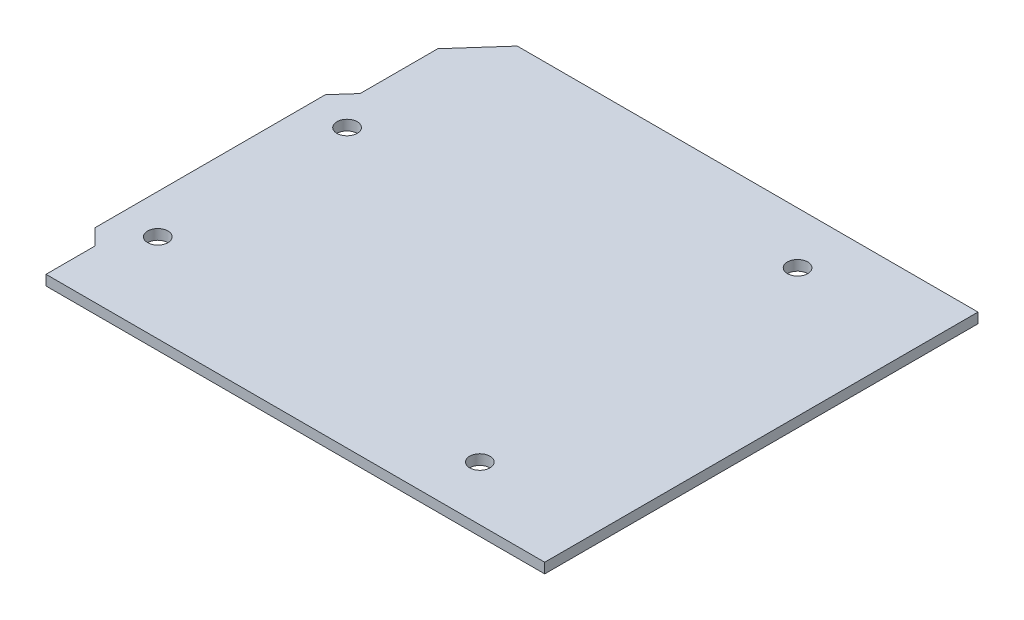
ISO-10303-21;
HEADER;
FILE_DESCRIPTION(('STEP AP214'),'2;1');
FILE_NAME('part.step','',(''),(''),'','','');
FILE_SCHEMA(('AUTOMOTIVE_DESIGN { 1 0 10303 214 1 1 1 1 }'));
ENDSEC;
DATA;
#1=APPLICATION_CONTEXT('core data for automotive mechanical design processes');
#2=APPLICATION_PROTOCOL_DEFINITION('international standard','automotive_design',2000,#1);
#3=PRODUCT_CONTEXT('',#1,'mechanical');
#4=PRODUCT('Part','Part','',(#3));
#5=PRODUCT_RELATED_PRODUCT_CATEGORY('part','',(#4));
#6=PRODUCT_DEFINITION_FORMATION('','',#4);
#7=PRODUCT_DEFINITION_CONTEXT('part definition',#1,'design');
#8=PRODUCT_DEFINITION('design','',#6,#7);
#9=PRODUCT_DEFINITION_SHAPE('','',#8);
#10=(LENGTH_UNIT() NAMED_UNIT(*) SI_UNIT(.MILLI.,.METRE.));
#11=(NAMED_UNIT(*) PLANE_ANGLE_UNIT() SI_UNIT($,.RADIAN.));
#12=(NAMED_UNIT(*) SI_UNIT($,.STERADIAN.) SOLID_ANGLE_UNIT());
#13=UNCERTAINTY_MEASURE_WITH_UNIT(LENGTH_MEASURE(1.E-05),#10,'distance_accuracy_value','');
#14=(GEOMETRIC_REPRESENTATION_CONTEXT(3) GLOBAL_UNCERTAINTY_ASSIGNED_CONTEXT((#13)) GLOBAL_UNIT_ASSIGNED_CONTEXT((#10,
#11,#12)) REPRESENTATION_CONTEXT('',''));
#15=CARTESIAN_POINT('',(0.,0.,0.));
#16=DIRECTION('',(0.,0.,1.));
#17=DIRECTION('',(1.,0.,0.));
#18=AXIS2_PLACEMENT_3D('',#15,#16,#17);
#19=CARTESIAN_POINT('',(-31.9361727476913,1.5,-32.1641220134032));
#20=DIRECTION('',(0.,0.,1.));
#21=DIRECTION('',(1.,0.,0.));
#22=AXIS2_PLACEMENT_3D('',#19,#20,#21);
#23=PLANE('',#22);
#24=DIRECTION('',(-1.,0.,0.));
#25=VECTOR('',#24,1.);
#26=CARTESIAN_POINT('',(-31.9361727476913,0.,-32.1641220134032));
#27=LINE('',#26,#25);
#28=CARTESIAN_POINT('',(36.1142071981815,0.,-32.1641220134031));
#29=VERTEX_POINT('',#28);
#30=CARTESIAN_POINT('',(-31.9361727476913,0.,-32.1641220134032));
#31=VERTEX_POINT('',#30);
#32=EDGE_CURVE('E164',#29,#31,#27,.T.);
#33=ORIENTED_EDGE('',*,*,#32,.T.);
#34=DIRECTION('',(0.,-1.,0.));
#35=VECTOR('',#34,1.);
#36=CARTESIAN_POINT('',(-31.9361727476913,1.5,-32.1641220134032));
#37=LINE('',#36,#35);
#38=CARTESIAN_POINT('',(-31.9361727476913,1.5,-32.1641220134032));
#39=VERTEX_POINT('',#38);
#40=EDGE_CURVE('E13',#39,#31,#37,.T.);
#41=ORIENTED_EDGE('',*,*,#40,.F.);
#42=DIRECTION('',(-1.,0.,0.));
#43=VECTOR('',#42,1.);
#44=CARTESIAN_POINT('',(-31.9361727476913,1.5,-32.1641220134032));
#45=LINE('',#44,#43);
#46=CARTESIAN_POINT('',(36.1142071981815,1.5,-32.1641220134031));
#47=VERTEX_POINT('',#46);
#48=EDGE_CURVE('E190',#47,#39,#45,.T.);
#49=ORIENTED_EDGE('',*,*,#48,.F.);
#50=DIRECTION('',(0.,-1.,0.));
#51=VECTOR('',#50,1.);
#52=CARTESIAN_POINT('',(36.1142071981815,1.5,-32.1641220134031));
#53=LINE('',#52,#51);
#54=EDGE_CURVE('E160',#47,#29,#53,.T.);
#55=ORIENTED_EDGE('',*,*,#54,.T.);
#56=EDGE_LOOP('',(#33,#41,#49,#55));
#57=FACE_BOUND('',#56,.T.);
#58=ADVANCED_FACE('F56',(#57),#23,.F.);
#59=CARTESIAN_POINT('',(-31.9361727476913,1.5,-32.1641220134032));
#60=DIRECTION('',(0.746798709244885,0.,0.665050139365577));
#61=DIRECTION('',(0.665050139365577,0.,-0.746798709244885));
#62=AXIS2_PLACEMENT_3D('',#59,#60,#61);
#63=PLANE('',#62);
#64=DIRECTION('',(-0.665050139365577,0.,0.746798709244885));
#65=VECTOR('',#64,1.);
#66=CARTESIAN_POINT('',(-31.9361727476913,0.,-32.1641220134032));
#67=LINE('',#66,#65);
#68=CARTESIAN_POINT('',(-37.4686203698186,0.,-25.9516208821186));
#69=VERTEX_POINT('',#68);
#70=EDGE_CURVE('E168',#31,#69,#67,.T.);
#71=ORIENTED_EDGE('',*,*,#70,.T.);
#72=DIRECTION('',(0.,-1.,0.));
#73=VECTOR('',#72,1.);
#74=CARTESIAN_POINT('',(-37.4686203698186,1.5,-25.9516208821186));
#75=LINE('',#74,#73);
#76=CARTESIAN_POINT('',(-37.4686203698186,1.5,-25.9516208821186));
#77=VERTEX_POINT('',#76);
#78=EDGE_CURVE('E65',#77,#69,#75,.T.);
#79=ORIENTED_EDGE('',*,*,#78,.F.);
#80=DIRECTION('',(-0.665050139365577,0.,0.746798709244885));
#81=VECTOR('',#80,1.);
#82=CARTESIAN_POINT('',(-31.9361727476913,1.5,-32.1641220134032));
#83=LINE('',#82,#81);
#84=EDGE_CURVE('E118',#39,#77,#83,.T.);
#85=ORIENTED_EDGE('',*,*,#84,.F.);
#86=ORIENTED_EDGE('',*,*,#40,.T.);
#87=EDGE_LOOP('',(#71,#79,#85,#86));
#88=FACE_BOUND('',#87,.T.);
#89=ADVANCED_FACE('F297',(#88),#63,.F.);
#90=CARTESIAN_POINT('',(-37.4686203698186,1.5,-25.9516208821186));
#91=DIRECTION('',(1.,0.,0.));
#92=DIRECTION('',(0.,0.,-1.));
#93=AXIS2_PLACEMENT_3D('',#90,#91,#92);
#94=PLANE('',#93);
#95=DIRECTION('',(0.,0.,1.));
#96=VECTOR('',#95,1.);
#97=CARTESIAN_POINT('',(-37.4686203698186,0.,-25.9516208821186));
#98=LINE('',#97,#96);
#99=CARTESIAN_POINT('',(-37.4686203698186,0.,-14.4830505743415));
#100=VERTEX_POINT('',#99);
#101=EDGE_CURVE('E172',#69,#100,#98,.T.);
#102=ORIENTED_EDGE('',*,*,#101,.T.);
#103=DIRECTION('',(0.,-1.,0.));
#104=VECTOR('',#103,1.);
#105=CARTESIAN_POINT('',(-37.4686203698186,1.5,-14.4830505743415));
#106=LINE('',#105,#104);
#107=CARTESIAN_POINT('',(-37.4686203698186,1.5,-14.4830505743415));
#108=VERTEX_POINT('',#107);
#109=EDGE_CURVE('E205',#108,#100,#106,.T.);
#110=ORIENTED_EDGE('',*,*,#109,.F.);
#111=DIRECTION('',(0.,0.,1.));
#112=VECTOR('',#111,1.);
#113=CARTESIAN_POINT('',(-37.4686203698186,1.5,-25.9516208821186));
#114=LINE('',#113,#112);
#115=EDGE_CURVE('E216',#77,#108,#114,.T.);
#116=ORIENTED_EDGE('',*,*,#115,.F.);
#117=ORIENTED_EDGE('',*,*,#78,.T.);
#118=EDGE_LOOP('',(#102,#110,#116,#117));
#119=FACE_BOUND('',#118,.T.);
#120=ADVANCED_FACE('F214',(#119),#94,.F.);
#121=CARTESIAN_POINT('',(-37.4686203698186,1.5,-14.4830505743415));
#122=DIRECTION('',(0.746798709244885,0.,0.665050139365577));
#123=DIRECTION('',(0.665050139365577,0.,-0.746798709244885));
#124=AXIS2_PLACEMENT_3D('',#121,#122,#123);
#125=PLANE('',#124);
#126=DIRECTION('',(-0.665050139365577,0.,0.746798709244885));
#127=VECTOR('',#126,1.);
#128=CARTESIAN_POINT('',(-37.4686203698186,0.,-14.4830505743415));
#129=LINE('',#128,#127);
#130=CARTESIAN_POINT('',(-39.8857928018185,0.,-11.7687571017292));
#131=VERTEX_POINT('',#130);
#132=EDGE_CURVE('E175',#100,#131,#129,.T.);
#133=ORIENTED_EDGE('',*,*,#132,.T.);
#134=DIRECTION('',(0.,-1.,0.));
#135=VECTOR('',#134,1.);
#136=CARTESIAN_POINT('',(-39.8857928018185,1.5,-11.7687571017292));
#137=LINE('',#136,#135);
#138=CARTESIAN_POINT('',(-39.8857928018185,1.5,-11.7687571017292));
#139=VERTEX_POINT('',#138);
#140=EDGE_CURVE('E201',#139,#131,#137,.T.);
#141=ORIENTED_EDGE('',*,*,#140,.F.);
#142=DIRECTION('',(-0.665050139365577,0.,0.746798709244885));
#143=VECTOR('',#142,1.);
#144=CARTESIAN_POINT('',(-37.4686203698186,1.5,-14.4830505743415));
#145=LINE('',#144,#143);
#146=EDGE_CURVE('E233',#108,#139,#145,.T.);
#147=ORIENTED_EDGE('',*,*,#146,.F.);
#148=ORIENTED_EDGE('',*,*,#109,.T.);
#149=EDGE_LOOP('',(#133,#141,#147,#148));
#150=FACE_BOUND('',#149,.T.);
#151=ADVANCED_FACE('F225',(#150),#125,.F.);
#152=CARTESIAN_POINT('',(-39.8857928018185,1.5,-11.7687571017292));
#153=DIRECTION('',(1.,0.,0.));
#154=DIRECTION('',(0.,0.,-1.));
#155=AXIS2_PLACEMENT_3D('',#152,#153,#154);
#156=PLANE('',#155);
#157=DIRECTION('',(0.,0.,1.));
#158=VECTOR('',#157,1.);
#159=CARTESIAN_POINT('',(-39.8857928018185,0.,-11.7687571017292));
#160=LINE('',#159,#158);
#161=CARTESIAN_POINT('',(-39.8857928018185,0.,22.2645318043648));
#162=VERTEX_POINT('',#161);
#163=EDGE_CURVE('E178',#131,#162,#160,.T.);
#164=ORIENTED_EDGE('',*,*,#163,.T.);
#165=DIRECTION('',(0.,-1.,0.));
#166=VECTOR('',#165,1.);
#167=CARTESIAN_POINT('',(-39.8857928018185,1.5,22.2645318043648));
#168=LINE('',#167,#166);
#169=CARTESIAN_POINT('',(-39.8857928018185,1.5,22.2645318043648));
#170=VERTEX_POINT('',#169);
#171=EDGE_CURVE('E197',#170,#162,#168,.T.);
#172=ORIENTED_EDGE('',*,*,#171,.F.);
#173=DIRECTION('',(0.,0.,1.));
#174=VECTOR('',#173,1.);
#175=CARTESIAN_POINT('',(-39.8857928018185,1.5,-11.7687571017292));
#176=LINE('',#175,#174);
#177=EDGE_CURVE('E231',#139,#170,#176,.T.);
#178=ORIENTED_EDGE('',*,*,#177,.F.);
#179=ORIENTED_EDGE('',*,*,#140,.T.);
#180=EDGE_LOOP('',(#164,#172,#178,#179));
#181=FACE_BOUND('',#180,.T.);
#182=ADVANCED_FACE('F229',(#181),#156,.F.);
#183=CARTESIAN_POINT('',(-39.8857928018185,1.5,22.2645318043648));
#184=DIRECTION('',(0.707106781186548,0.,-0.707106781186547));
#185=DIRECTION('',(-0.707106781186547,0.,-0.707106781186548));
#186=AXIS2_PLACEMENT_3D('',#183,#184,#185);
#187=PLANE('',#186);
#188=DIRECTION('',(0.707106781186547,0.,0.707106781186548));
#189=VECTOR('',#188,1.);
#190=CARTESIAN_POINT('',(-39.8857928018185,0.,22.2645318043648));
#191=LINE('',#190,#189);
#192=CARTESIAN_POINT('',(-37.5479766291017,0.,24.6023479770816));
#193=VERTEX_POINT('',#192);
#194=EDGE_CURVE('E181',#162,#193,#191,.T.);
#195=ORIENTED_EDGE('',*,*,#194,.T.);
#196=DIRECTION('',(0.,-1.,0.));
#197=VECTOR('',#196,1.);
#198=CARTESIAN_POINT('',(-37.5479766291017,1.5,24.6023479770816));
#199=LINE('',#198,#197);
#200=CARTESIAN_POINT('',(-37.5479766291017,1.5,24.6023479770816));
#201=VERTEX_POINT('',#200);
#202=EDGE_CURVE('E152',#201,#193,#199,.T.);
#203=ORIENTED_EDGE('',*,*,#202,.F.);
#204=DIRECTION('',(0.707106781186547,0.,0.707106781186548));
#205=VECTOR('',#204,1.);
#206=CARTESIAN_POINT('',(-39.8857928018185,1.5,22.2645318043648));
#207=LINE('',#206,#205);
#208=EDGE_CURVE('E140',#170,#201,#207,.T.);
#209=ORIENTED_EDGE('',*,*,#208,.F.);
#210=ORIENTED_EDGE('',*,*,#171,.T.);
#211=EDGE_LOOP('',(#195,#203,#209,#210));
#212=FACE_BOUND('',#211,.T.);
#213=ADVANCED_FACE('F305',(#212),#187,.F.);
#214=CARTESIAN_POINT('',(-37.5479766291017,1.5,24.6023479770816));
#215=DIRECTION('',(1.,0.,0.));
#216=DIRECTION('',(0.,0.,-1.));
#217=AXIS2_PLACEMENT_3D('',#214,#215,#216);
#218=PLANE('',#217);
#219=DIRECTION('',(0.,0.,1.));
#220=VECTOR('',#219,1.);
#221=CARTESIAN_POINT('',(-37.5479766291017,0.,24.6023479770816));
#222=LINE('',#221,#220);
#223=CARTESIAN_POINT('',(-37.5479766291017,0.,31.8358779865968));
#224=VERTEX_POINT('',#223);
#225=EDGE_CURVE('E150',#193,#224,#222,.T.);
#226=ORIENTED_EDGE('',*,*,#225,.T.);
#227=DIRECTION('',(0.,-1.,0.));
#228=VECTOR('',#227,1.);
#229=CARTESIAN_POINT('',(-37.5479766291017,1.5,31.8358779865968));
#230=LINE('',#229,#228);
#231=CARTESIAN_POINT('',(-37.5479766291017,1.5,31.8358779865968));
#232=VERTEX_POINT('',#231);
#233=EDGE_CURVE('E147',#232,#224,#230,.T.);
#234=ORIENTED_EDGE('',*,*,#233,.F.);
#235=DIRECTION('',(0.,0.,1.));
#236=VECTOR('',#235,1.);
#237=CARTESIAN_POINT('',(-37.5479766291017,1.5,24.6023479770816));
#238=LINE('',#237,#236);
#239=EDGE_CURVE('E134',#201,#232,#238,.T.);
#240=ORIENTED_EDGE('',*,*,#239,.F.);
#241=ORIENTED_EDGE('',*,*,#202,.T.);
#242=EDGE_LOOP('',(#226,#234,#240,#241));
#243=FACE_BOUND('',#242,.T.);
#244=ADVANCED_FACE('F148',(#243),#218,.F.);
#245=CARTESIAN_POINT('',(-31.6123750802995,1.5,31.8358779865968));
#246=DIRECTION('',(0.,0.,-1.));
#247=DIRECTION('',(-1.,0.,0.));
#248=AXIS2_PLACEMENT_3D('',#245,#246,#247);
#249=PLANE('',#248);
#250=DIRECTION('',(1.,0.,0.));
#251=VECTOR('',#250,1.);
#252=CARTESIAN_POINT('',(-31.6123750802995,0.,31.8358779865968));
#253=LINE('',#252,#251);
#254=CARTESIAN_POINT('',(36.1142071981815,0.,31.8358779865968));
#255=VERTEX_POINT('',#254);
#256=EDGE_CURVE('E104',#224,#255,#253,.T.);
#257=ORIENTED_EDGE('',*,*,#256,.T.);
#258=DIRECTION('',(0.,-1.,0.));
#259=VECTOR('',#258,1.);
#260=CARTESIAN_POINT('',(36.1142071981815,1.5,31.8358779865968));
#261=LINE('',#260,#259);
#262=CARTESIAN_POINT('',(36.1142071981815,1.5,31.8358779865968));
#263=VERTEX_POINT('',#262);
#264=EDGE_CURVE('E153',#263,#255,#261,.T.);
#265=ORIENTED_EDGE('',*,*,#264,.F.);
#266=DIRECTION('',(1.,0.,0.));
#267=VECTOR('',#266,1.);
#268=CARTESIAN_POINT('',(-37.5479766291017,1.5,31.8358779865968));
#269=LINE('',#268,#267);
#270=EDGE_CURVE('E138',#232,#263,#269,.T.);
#271=ORIENTED_EDGE('',*,*,#270,.F.);
#272=ORIENTED_EDGE('',*,*,#233,.T.);
#273=EDGE_LOOP('',(#257,#265,#271,#272));
#274=FACE_BOUND('',#273,.T.);
#275=ADVANCED_FACE('F155',(#274),#249,.F.);
#276=CARTESIAN_POINT('',(36.1142071981815,1.5,-32.1641220134031));
#277=DIRECTION('',(-1.,0.,0.));
#278=DIRECTION('',(0.,0.,1.));
#279=AXIS2_PLACEMENT_3D('',#276,#277,#278);
#280=PLANE('',#279);
#281=DIRECTION('',(0.,0.,-1.));
#282=VECTOR('',#281,1.);
#283=CARTESIAN_POINT('',(36.1142071981815,0.,-32.1641220134031));
#284=LINE('',#283,#282);
#285=EDGE_CURVE('E110',#255,#29,#284,.T.);
#286=ORIENTED_EDGE('',*,*,#285,.T.);
#287=ORIENTED_EDGE('',*,*,#54,.F.);
#288=DIRECTION('',(0.,0.,-1.));
#289=VECTOR('',#288,1.);
#290=CARTESIAN_POINT('',(36.1142071981815,1.5,-32.1641220134031));
#291=LINE('',#290,#289);
#292=EDGE_CURVE('E73',#263,#47,#291,.T.);
#293=ORIENTED_EDGE('',*,*,#292,.F.);
#294=ORIENTED_EDGE('',*,*,#264,.T.);
#295=EDGE_LOOP('',(#286,#287,#293,#294));
#296=FACE_BOUND('',#295,.T.);
#297=ADVANCED_FACE('F354',(#296),#280,.F.);
#298=CARTESIAN_POINT('',(0.,1.5,0.));
#299=DIRECTION('',(0.,-1.,0.));
#300=DIRECTION('',(0.,0.,-1.));
#301=AXIS2_PLACEMENT_3D('',#298,#299,#300);
#302=PLANE('',#301);
#303=CARTESIAN_POINT('',(18.5049817703962,1.5,23.809750534651));
#304=DIRECTION('',(0.,1.,0.));
#305=DIRECTION('',(0.,0.,1.));
#306=AXIS2_PLACEMENT_3D('',#303,#304,#305);
#307=CIRCLE('',#306,1.5);
#308=CARTESIAN_POINT('',(18.5049817703962,1.5,25.309750534651));
#309=VERTEX_POINT('',#308);
#310=EDGE_CURVE('E254',#309,#309,#307,.T.);
#311=ORIENTED_EDGE('',*,*,#310,.F.);
#312=EDGE_LOOP('',(#311));
#313=FACE_BOUND('',#312,.T.);
#314=CARTESIAN_POINT('',(17.1262006118488,1.5,-24.50342872962));
#315=DIRECTION('',(0.,1.,0.));
#316=DIRECTION('',(0.,0.,1.));
#317=AXIS2_PLACEMENT_3D('',#314,#315,#316);
#318=CIRCLE('',#317,1.5);
#319=CARTESIAN_POINT('',(17.1262006118488,1.5,-23.00342872962));
#320=VERTEX_POINT('',#319);
#321=EDGE_CURVE('E262',#320,#320,#318,.T.);
#322=ORIENTED_EDGE('',*,*,#321,.F.);
#323=EDGE_LOOP('',(#322));
#324=FACE_BOUND('',#323,.T.);
#325=CARTESIAN_POINT('',(-34.0850402687002,1.5,18.7847322873986));
#326=DIRECTION('',(0.,1.,0.));
#327=DIRECTION('',(0.,0.,1.));
#328=AXIS2_PLACEMENT_3D('',#325,#326,#327);
#329=CIRCLE('',#328,1.5);
#330=CARTESIAN_POINT('',(-34.0850402687002,1.5,20.2847322873986));
#331=VERTEX_POINT('',#330);
#332=EDGE_CURVE('E270',#331,#331,#329,.T.);
#333=ORIENTED_EDGE('',*,*,#332,.F.);
#334=EDGE_LOOP('',(#333));
#335=FACE_BOUND('',#334,.T.);
#336=CARTESIAN_POINT('',(-34.0859402044805,1.5,-9.17148979754561));
#337=DIRECTION('',(0.,1.,0.));
#338=DIRECTION('',(0.,0.,1.));
#339=AXIS2_PLACEMENT_3D('',#336,#337,#338);
#340=CIRCLE('',#339,1.5);
#341=CARTESIAN_POINT('',(-34.0859402044805,1.5,-7.6714897975456));
#342=VERTEX_POINT('',#341);
#343=EDGE_CURVE('E169',#342,#342,#340,.T.);
#344=ORIENTED_EDGE('',*,*,#343,.F.);
#345=EDGE_LOOP('',(#344));
#346=FACE_BOUND('',#345,.T.);
#347=ORIENTED_EDGE('',*,*,#48,.T.);
#348=ORIENTED_EDGE('',*,*,#84,.T.);
#349=ORIENTED_EDGE('',*,*,#115,.T.);
#350=ORIENTED_EDGE('',*,*,#146,.T.);
#351=ORIENTED_EDGE('',*,*,#177,.T.);
#352=ORIENTED_EDGE('',*,*,#208,.T.);
#353=ORIENTED_EDGE('',*,*,#239,.T.);
#354=ORIENTED_EDGE('',*,*,#270,.T.);
#355=ORIENTED_EDGE('',*,*,#292,.T.);
#356=EDGE_LOOP('',(#347,#348,#349,#350,#351,#352,#353,#354,#355));
#357=FACE_BOUND('',#356,.T.);
#358=ADVANCED_FACE('F136',(#313,#324,#335,#346,#357),#302,.F.);
#359=CARTESIAN_POINT('',(0.,0.,0.));
#360=DIRECTION('',(0.,-1.,0.));
#361=DIRECTION('',(0.,0.,-1.));
#362=AXIS2_PLACEMENT_3D('',#359,#360,#361);
#363=PLANE('',#362);
#364=CARTESIAN_POINT('',(18.5049817703962,0.,23.809750534651));
#365=DIRECTION('',(0.,1.,0.));
#366=DIRECTION('',(0.,0.,1.));
#367=AXIS2_PLACEMENT_3D('',#364,#365,#366);
#368=CIRCLE('',#367,1.5);
#369=CARTESIAN_POINT('',(18.5049817703962,0.,25.309750534651));
#370=VERTEX_POINT('',#369);
#371=EDGE_CURVE('E258',#370,#370,#368,.T.);
#372=ORIENTED_EDGE('',*,*,#371,.T.);
#373=EDGE_LOOP('',(#372));
#374=FACE_BOUND('',#373,.T.);
#375=CARTESIAN_POINT('',(17.1262006118488,0.,-24.50342872962));
#376=DIRECTION('',(0.,1.,0.));
#377=DIRECTION('',(0.,0.,1.));
#378=AXIS2_PLACEMENT_3D('',#375,#376,#377);
#379=CIRCLE('',#378,1.5);
#380=CARTESIAN_POINT('',(17.1262006118488,0.,-23.00342872962));
#381=VERTEX_POINT('',#380);
#382=EDGE_CURVE('E266',#381,#381,#379,.T.);
#383=ORIENTED_EDGE('',*,*,#382,.T.);
#384=EDGE_LOOP('',(#383));
#385=FACE_BOUND('',#384,.T.);
#386=CARTESIAN_POINT('',(-34.0850402687002,0.,18.7847322873986));
#387=DIRECTION('',(0.,1.,0.));
#388=DIRECTION('',(0.,0.,1.));
#389=AXIS2_PLACEMENT_3D('',#386,#387,#388);
#390=CIRCLE('',#389,1.5);
#391=CARTESIAN_POINT('',(-34.0850402687002,0.,20.2847322873986));
#392=VERTEX_POINT('',#391);
#393=EDGE_CURVE('E250',#392,#392,#390,.T.);
#394=ORIENTED_EDGE('',*,*,#393,.T.);
#395=EDGE_LOOP('',(#394));
#396=FACE_BOUND('',#395,.T.);
#397=CARTESIAN_POINT('',(-34.0859402044805,0.,-9.17148979754561));
#398=DIRECTION('',(0.,1.,0.));
#399=DIRECTION('',(0.,0.,1.));
#400=AXIS2_PLACEMENT_3D('',#397,#398,#399);
#401=CIRCLE('',#400,1.5);
#402=CARTESIAN_POINT('',(-34.0859402044805,0.,-7.6714897975456));
#403=VERTEX_POINT('',#402);
#404=EDGE_CURVE('E246',#403,#403,#401,.T.);
#405=ORIENTED_EDGE('',*,*,#404,.T.);
#406=EDGE_LOOP('',(#405));
#407=FACE_BOUND('',#406,.T.);
#408=ORIENTED_EDGE('',*,*,#32,.F.);
#409=ORIENTED_EDGE('',*,*,#285,.F.);
#410=ORIENTED_EDGE('',*,*,#256,.F.);
#411=ORIENTED_EDGE('',*,*,#225,.F.);
#412=ORIENTED_EDGE('',*,*,#194,.F.);
#413=ORIENTED_EDGE('',*,*,#163,.F.);
#414=ORIENTED_EDGE('',*,*,#132,.F.);
#415=ORIENTED_EDGE('',*,*,#101,.F.);
#416=ORIENTED_EDGE('',*,*,#70,.F.);
#417=EDGE_LOOP('',(#408,#409,#410,#411,#412,#413,#414,#415,#416));
#418=FACE_BOUND('',#417,.T.);
#419=ADVANCED_FACE('F220',(#374,#385,#396,#407,#418),#363,.T.);
#420=CARTESIAN_POINT('',(-34.0859402044805,1.5,-9.17148979754561));
#421=DIRECTION('',(0.,-1.,0.));
#422=DIRECTION('',(0.,0.,-1.));
#423=AXIS2_PLACEMENT_3D('',#420,#421,#422);
#424=CYLINDRICAL_SURFACE('',#423,1.5);
#425=ORIENTED_EDGE('',*,*,#343,.T.);
#426=EDGE_LOOP('',(#425));
#427=FACE_BOUND('',#426,.T.);
#428=ORIENTED_EDGE('',*,*,#404,.F.);
#429=EDGE_LOOP('',(#428));
#430=FACE_BOUND('',#429,.T.);
#431=ADVANCED_FACE('F284',(#427,#430),#424,.F.);
#432=CARTESIAN_POINT('',(-34.0850402687002,1.5,18.7847322873986));
#433=DIRECTION('',(0.,-1.,0.));
#434=DIRECTION('',(0.,0.,-1.));
#435=AXIS2_PLACEMENT_3D('',#432,#433,#434);
#436=CYLINDRICAL_SURFACE('',#435,1.5);
#437=ORIENTED_EDGE('',*,*,#332,.T.);
#438=EDGE_LOOP('',(#437));
#439=FACE_BOUND('',#438,.T.);
#440=ORIENTED_EDGE('',*,*,#393,.F.);
#441=EDGE_LOOP('',(#440));
#442=FACE_BOUND('',#441,.T.);
#443=ADVANCED_FACE('F281',(#439,#442),#436,.F.);
#444=CARTESIAN_POINT('',(17.1262006118488,1.5,-24.50342872962));
#445=DIRECTION('',(0.,-1.,0.));
#446=DIRECTION('',(0.,0.,-1.));
#447=AXIS2_PLACEMENT_3D('',#444,#445,#446);
#448=CYLINDRICAL_SURFACE('',#447,1.5);
#449=ORIENTED_EDGE('',*,*,#321,.T.);
#450=EDGE_LOOP('',(#449));
#451=FACE_BOUND('',#450,.T.);
#452=ORIENTED_EDGE('',*,*,#382,.F.);
#453=EDGE_LOOP('',(#452));
#454=FACE_BOUND('',#453,.T.);
#455=ADVANCED_FACE('F283',(#451,#454),#448,.F.);
#456=CARTESIAN_POINT('',(18.5049817703962,1.5,23.809750534651));
#457=DIRECTION('',(0.,-1.,0.));
#458=DIRECTION('',(0.,0.,-1.));
#459=AXIS2_PLACEMENT_3D('',#456,#457,#458);
#460=CYLINDRICAL_SURFACE('',#459,1.5);
#461=ORIENTED_EDGE('',*,*,#310,.T.);
#462=EDGE_LOOP('',(#461));
#463=FACE_BOUND('',#462,.T.);
#464=ORIENTED_EDGE('',*,*,#371,.F.);
#465=EDGE_LOOP('',(#464));
#466=FACE_BOUND('',#465,.T.);
#467=ADVANCED_FACE('F291',(#463,#466),#460,.F.);
#468=CLOSED_SHELL('',(#58,#89,#120,#151,#182,#213,#244,#275,#297,#358,#419,#431,#443,#455,#467));
#469=MANIFOLD_SOLID_BREP('B2',#468);
#470=ADVANCED_BREP_SHAPE_REPRESENTATION('',(#18,#469),#14);
#471=SHAPE_DEFINITION_REPRESENTATION(#9,#470);
ENDSEC;
END-ISO-10303-21;
